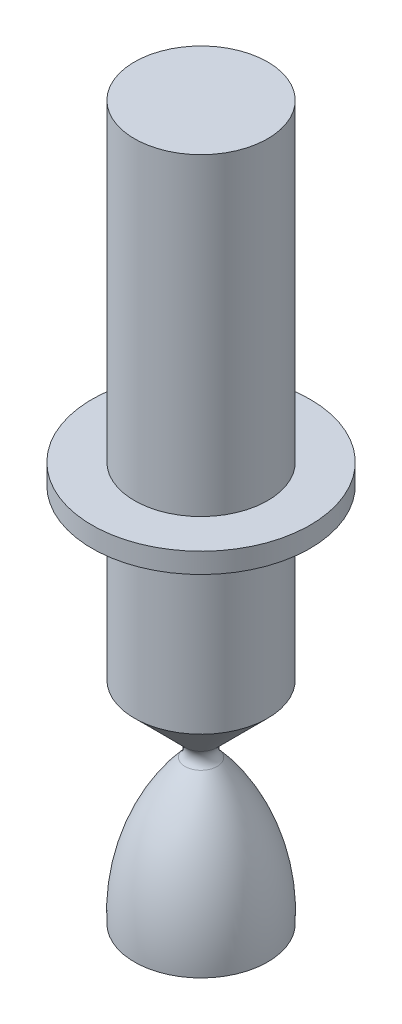
ISO-10303-21;
HEADER;
FILE_DESCRIPTION(('STEP AP214'),'2;1');
FILE_NAME('part.step','',(''),(''),'','','');
FILE_SCHEMA(('AUTOMOTIVE_DESIGN { 1 0 10303 214 1 1 1 1 }'));
ENDSEC;
DATA;
#1=APPLICATION_CONTEXT('core data for automotive mechanical design processes');
#2=APPLICATION_PROTOCOL_DEFINITION('international standard','automotive_design',2000,#1);
#3=PRODUCT_CONTEXT('',#1,'mechanical');
#4=PRODUCT('Part','Part','',(#3));
#5=PRODUCT_RELATED_PRODUCT_CATEGORY('part','',(#4));
#6=PRODUCT_DEFINITION_FORMATION('','',#4);
#7=PRODUCT_DEFINITION_CONTEXT('part definition',#1,'design');
#8=PRODUCT_DEFINITION('design','',#6,#7);
#9=PRODUCT_DEFINITION_SHAPE('','',#8);
#10=(LENGTH_UNIT() NAMED_UNIT(*) SI_UNIT(.MILLI.,.METRE.));
#11=(NAMED_UNIT(*) PLANE_ANGLE_UNIT() SI_UNIT($,.RADIAN.));
#12=(NAMED_UNIT(*) SI_UNIT($,.STERADIAN.) SOLID_ANGLE_UNIT());
#13=UNCERTAINTY_MEASURE_WITH_UNIT(LENGTH_MEASURE(1.E-05),#10,'distance_accuracy_value','');
#14=(GEOMETRIC_REPRESENTATION_CONTEXT(3) GLOBAL_UNCERTAINTY_ASSIGNED_CONTEXT((#13)) GLOBAL_UNIT_ASSIGNED_CONTEXT((#10,
#11,#12)) REPRESENTATION_CONTEXT('',''));
#15=CARTESIAN_POINT('',(0.,0.,0.));
#16=DIRECTION('',(0.,0.,1.));
#17=DIRECTION('',(1.,0.,0.));
#18=AXIS2_PLACEMENT_3D('',#15,#16,#17);
#19=CARTESIAN_POINT('',(27.8405752343016,102.,0.));
#20=DIRECTION('',(0.,1.,0.));
#21=DIRECTION('',(0.,0.,1.));
#22=AXIS2_PLACEMENT_3D('',#19,#20,#21);
#23=PLANE('',#22);
#24=CARTESIAN_POINT('',(0.,102.,0.));
#25=DIRECTION('',(0.,-1.,0.));
#26=DIRECTION('',(0.,0.,-1.));
#27=AXIS2_PLACEMENT_3D('',#24,#25,#26);
#28=CIRCLE('',#27,17.);
#29=CARTESIAN_POINT('',(0.,102.,-17.));
#30=VERTEX_POINT('',#29);
#31=EDGE_CURVE('E68',#30,#30,#28,.T.);
#32=ORIENTED_EDGE('',*,*,#31,.T.);
#33=EDGE_LOOP('',(#32));
#34=FACE_BOUND('',#33,.T.);
#35=CARTESIAN_POINT('',(0.,102.,0.));
#36=DIRECTION('',(0.,-1.,0.));
#37=DIRECTION('',(0.,0.,-1.));
#38=AXIS2_PLACEMENT_3D('',#35,#36,#37);
#39=CIRCLE('',#38,27.8405752343016);
#40=CARTESIAN_POINT('',(0.,102.,-27.8405752343016));
#41=VERTEX_POINT('',#40);
#42=EDGE_CURVE('E10',#41,#41,#39,.T.);
#43=ORIENTED_EDGE('',*,*,#42,.F.);
#44=EDGE_LOOP('',(#43));
#45=FACE_BOUND('',#44,.T.);
#46=ADVANCED_FACE('F37',(#34,#45),#23,.T.);
#47=CARTESIAN_POINT('',(0.,0.,0.));
#48=DIRECTION('',(0.,-1.,0.));
#49=DIRECTION('',(0.,0.,-1.));
#50=AXIS2_PLACEMENT_3D('',#47,#48,#49);
#51=CYLINDRICAL_SURFACE('',#50,27.8405752343016);
#52=ORIENTED_EDGE('',*,*,#42,.T.);
#53=EDGE_LOOP('',(#52));
#54=FACE_BOUND('',#53,.T.);
#55=CARTESIAN_POINT('',(0.,96.8522662612667,0.));
#56=DIRECTION('',(0.,-1.,0.));
#57=DIRECTION('',(0.,0.,-1.));
#58=AXIS2_PLACEMENT_3D('',#55,#56,#57);
#59=CIRCLE('',#58,27.8405752343016);
#60=CARTESIAN_POINT('',(0.,96.8522662612667,-27.8405752343016));
#61=VERTEX_POINT('',#60);
#62=EDGE_CURVE('E43',#61,#61,#59,.T.);
#63=ORIENTED_EDGE('',*,*,#62,.F.);
#64=EDGE_LOOP('',(#63));
#65=FACE_BOUND('',#64,.T.);
#66=ADVANCED_FACE('F86',(#54,#65),#51,.T.);
#67=CARTESIAN_POINT('',(17.,96.8522662612667,0.));
#68=DIRECTION('',(0.,-1.,0.));
#69=DIRECTION('',(0.,0.,-1.));
#70=AXIS2_PLACEMENT_3D('',#67,#68,#69);
#71=PLANE('',#70);
#72=ORIENTED_EDGE('',*,*,#62,.T.);
#73=EDGE_LOOP('',(#72));
#74=FACE_BOUND('',#73,.T.);
#75=CARTESIAN_POINT('',(0.,96.8522662612667,0.));
#76=DIRECTION('',(0.,-1.,0.));
#77=DIRECTION('',(0.,0.,-1.));
#78=AXIS2_PLACEMENT_3D('',#75,#76,#77);
#79=CIRCLE('',#78,17.);
#80=CARTESIAN_POINT('',(0.,96.8522662612667,-17.));
#81=VERTEX_POINT('',#80);
#82=EDGE_CURVE('E47',#81,#81,#79,.T.);
#83=ORIENTED_EDGE('',*,*,#82,.F.);
#84=EDGE_LOOP('',(#83));
#85=FACE_BOUND('',#84,.T.);
#86=ADVANCED_FACE('F90',(#74,#85),#71,.T.);
#87=CARTESIAN_POINT('',(0.,0.,0.));
#88=DIRECTION('',(0.,-1.,0.));
#89=DIRECTION('',(0.,0.,-1.));
#90=AXIS2_PLACEMENT_3D('',#87,#88,#89);
#91=CYLINDRICAL_SURFACE('',#90,17.);
#92=ORIENTED_EDGE('',*,*,#82,.T.);
#93=EDGE_LOOP('',(#92));
#94=FACE_BOUND('',#93,.T.);
#95=CARTESIAN_POINT('',(0.,53.8805211512632,0.));
#96=DIRECTION('',(0.,-1.,0.));
#97=DIRECTION('',(0.,0.,-1.));
#98=AXIS2_PLACEMENT_3D('',#95,#96,#97);
#99=CIRCLE('',#98,17.);
#100=CARTESIAN_POINT('',(0.,53.8805211512632,-17.));
#101=VERTEX_POINT('',#100);
#102=EDGE_CURVE('E51',#101,#101,#99,.T.);
#103=ORIENTED_EDGE('',*,*,#102,.F.);
#104=EDGE_LOOP('',(#103));
#105=FACE_BOUND('',#104,.T.);
#106=ADVANCED_FACE('F94',(#94,#105),#91,.T.);
#107=CARTESIAN_POINT('',(0.,40.9719708252635,0.));
#108=DIRECTION('',(0.,1.,0.));
#109=DIRECTION('',(0.,0.,1.));
#110=AXIS2_PLACEMENT_3D('',#107,#108,#109);
#111=CONICAL_SURFACE('',#110,4.09144967400021,0.785398163397451);
#112=ORIENTED_EDGE('',*,*,#102,.T.);
#113=EDGE_LOOP('',(#112));
#114=FACE_BOUND('',#113,.T.);
#115=CARTESIAN_POINT('',(0.,40.9719708252635,0.));
#116=DIRECTION('',(0.,-1.,0.));
#117=DIRECTION('',(0.,0.,-1.));
#118=AXIS2_PLACEMENT_3D('',#115,#116,#117);
#119=CIRCLE('',#118,4.09144967400021);
#120=CARTESIAN_POINT('',(0.,40.9719708252635,-4.09144967400021));
#121=VERTEX_POINT('',#120);
#122=EDGE_CURVE('E56',#121,#121,#119,.T.);
#123=ORIENTED_EDGE('',*,*,#122,.F.);
#124=EDGE_LOOP('',(#123));
#125=FACE_BOUND('',#124,.T.);
#126=ADVANCED_FACE('F100',(#114,#125),#111,.T.);
#127=CARTESIAN_POINT('',(0.,38.8764597464134,0.));
#128=DIRECTION('',(0.,-1.,0.));
#129=DIRECTION('',(0.,0.,-1.));
#130=AXIS2_PLACEMENT_3D('',#127,#128,#129);
#131=TOROIDAL_SURFACE('',#130,6.18696075285032,2.96350018781291);
#132=ORIENTED_EDGE('',*,*,#122,.T.);
#133=EDGE_LOOP('',(#132));
#134=FACE_BOUND('',#133,.T.);
#135=CARTESIAN_POINT('',(0.,36.7809486675632,0.));
#136=DIRECTION('',(0.,-1.,0.));
#137=DIRECTION('',(0.,0.,-1.));
#138=AXIS2_PLACEMENT_3D('',#135,#136,#137);
#139=CIRCLE('',#138,4.09144967400023);
#140=CARTESIAN_POINT('',(0.,36.7809486675632,-4.09144967400023));
#141=VERTEX_POINT('',#140);
#142=EDGE_CURVE('E59',#141,#141,#139,.T.);
#143=ORIENTED_EDGE('',*,*,#142,.F.);
#144=EDGE_LOOP('',(#143));
#145=FACE_BOUND('',#144,.T.);
#146=ADVANCED_FACE('F104',(#134,#145),#131,.F.);
#147=CARTESIAN_POINT('',(0.,2.53955488218506,0.));
#148=DIRECTION('',(0.,-1.,0.));
#149=DIRECTION('',(0.,0.,-1.));
#150=AXIS2_PLACEMENT_3D('',#147,#148,#149);
#151=DEGENERATE_TOROIDAL_SURFACE('',#150,34.6190566418758,51.6814894096214,.F.);
#152=ORIENTED_EDGE('',*,*,#142,.T.);
#153=EDGE_LOOP('',(#152));
#154=FACE_BOUND('',#153,.T.);
#155=CARTESIAN_POINT('',(0.,0.,0.));
#156=DIRECTION('',(0.,-1.,0.));
#157=DIRECTION('',(0.,0.,-1.));
#158=AXIS2_PLACEMENT_3D('',#155,#156,#157);
#159=CIRCLE('',#158,17.);
#160=CARTESIAN_POINT('',(0.,0.,-17.));
#161=VERTEX_POINT('',#160);
#162=EDGE_CURVE('E62',#161,#161,#159,.T.);
#163=ORIENTED_EDGE('',*,*,#162,.F.);
#164=EDGE_LOOP('',(#163));
#165=FACE_BOUND('',#164,.T.);
#166=ADVANCED_FACE('F108',(#154,#165),#151,.F.);
#167=CARTESIAN_POINT('',(0.,0.,0.));
#168=DIRECTION('',(0.,-1.,0.));
#169=DIRECTION('',(0.,0.,-1.));
#170=AXIS2_PLACEMENT_3D('',#167,#168,#169);
#171=PLANE('',#170);
#172=ORIENTED_EDGE('',*,*,#162,.T.);
#173=EDGE_LOOP('',(#172));
#174=FACE_BOUND('',#173,.T.);
#175=ADVANCED_FACE('F82',(#174),#171,.T.);
#176=CARTESIAN_POINT('',(0.,182.,0.));
#177=DIRECTION('',(0.,1.,0.));
#178=DIRECTION('',(0.,0.,1.));
#179=AXIS2_PLACEMENT_3D('',#176,#177,#178);
#180=PLANE('',#179);
#181=CARTESIAN_POINT('',(0.,182.,0.));
#182=DIRECTION('',(0.,-1.,0.));
#183=DIRECTION('',(0.,0.,-1.));
#184=AXIS2_PLACEMENT_3D('',#181,#182,#183);
#185=CIRCLE('',#184,17.);
#186=CARTESIAN_POINT('',(0.,182.,-17.));
#187=VERTEX_POINT('',#186);
#188=EDGE_CURVE('E65',#187,#187,#185,.T.);
#189=ORIENTED_EDGE('',*,*,#188,.F.);
#190=EDGE_LOOP('',(#189));
#191=FACE_BOUND('',#190,.T.);
#192=ADVANCED_FACE('F76',(#191),#180,.T.);
#193=CARTESIAN_POINT('',(0.,102.,0.));
#194=DIRECTION('',(0.,-1.,0.));
#195=DIRECTION('',(0.,0.,-1.));
#196=AXIS2_PLACEMENT_3D('',#193,#194,#195);
#197=CYLINDRICAL_SURFACE('',#196,17.);
#198=ORIENTED_EDGE('',*,*,#188,.T.);
#199=EDGE_LOOP('',(#198));
#200=FACE_BOUND('',#199,.T.);
#201=ORIENTED_EDGE('',*,*,#31,.F.);
#202=EDGE_LOOP('',(#201));
#203=FACE_BOUND('',#202,.T.);
#204=ADVANCED_FACE('F74',(#200,#203),#197,.T.);
#205=CLOSED_SHELL('',(#46,#66,#86,#106,#126,#146,#166,#175,#192,#204));
#206=MANIFOLD_SOLID_BREP('B2',#205);
#207=ADVANCED_BREP_SHAPE_REPRESENTATION('',(#18,#206),#14);
#208=SHAPE_DEFINITION_REPRESENTATION(#9,#207);
ENDSEC;
END-ISO-10303-21;
